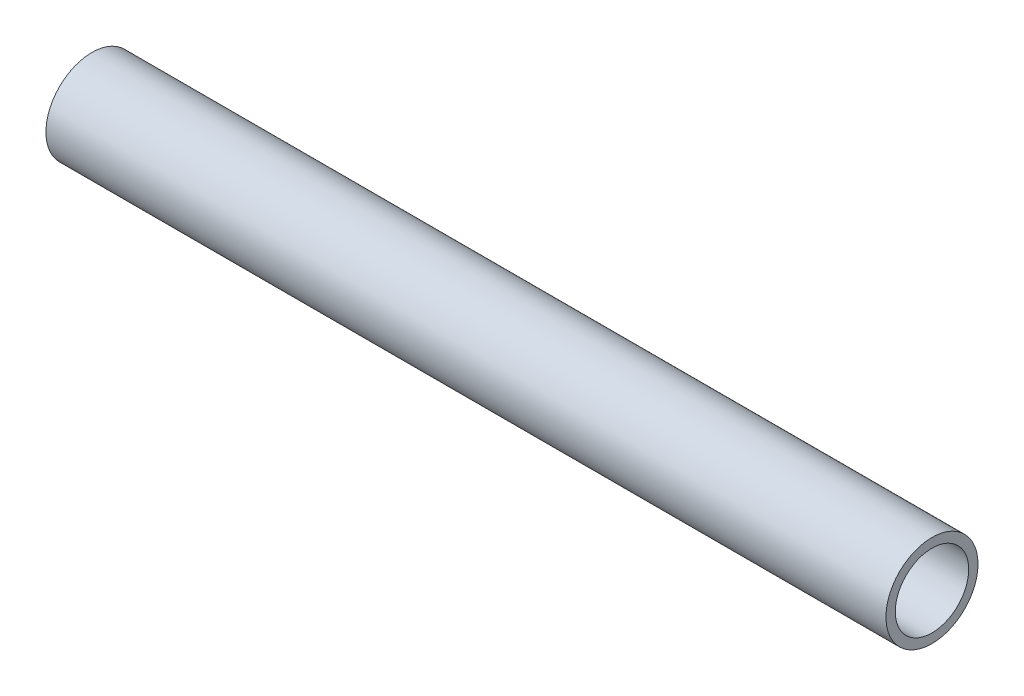
ISO-10303-21;
HEADER;
FILE_DESCRIPTION(('STEP AP214'),'2;1');
FILE_NAME('part.step','',(''),(''),'','','');
FILE_SCHEMA(('AUTOMOTIVE_DESIGN { 1 0 10303 214 1 1 1 1 }'));
ENDSEC;
DATA;
#1=APPLICATION_CONTEXT('core data for automotive mechanical design processes');
#2=APPLICATION_PROTOCOL_DEFINITION('international standard','automotive_design',2000,#1);
#3=PRODUCT_CONTEXT('',#1,'mechanical');
#4=PRODUCT('Part','Part','',(#3));
#5=PRODUCT_RELATED_PRODUCT_CATEGORY('part','',(#4));
#6=PRODUCT_DEFINITION_FORMATION('','',#4);
#7=PRODUCT_DEFINITION_CONTEXT('part definition',#1,'design');
#8=PRODUCT_DEFINITION('design','',#6,#7);
#9=PRODUCT_DEFINITION_SHAPE('','',#8);
#10=(LENGTH_UNIT() NAMED_UNIT(*) SI_UNIT(.MILLI.,.METRE.));
#11=(NAMED_UNIT(*) PLANE_ANGLE_UNIT() SI_UNIT($,.RADIAN.));
#12=(NAMED_UNIT(*) SI_UNIT($,.STERADIAN.) SOLID_ANGLE_UNIT());
#13=UNCERTAINTY_MEASURE_WITH_UNIT(LENGTH_MEASURE(1.E-05),#10,'distance_accuracy_value','');
#14=(GEOMETRIC_REPRESENTATION_CONTEXT(3) GLOBAL_UNCERTAINTY_ASSIGNED_CONTEXT((#13)) GLOBAL_UNIT_ASSIGNED_CONTEXT((#10,
#11,#12)) REPRESENTATION_CONTEXT('',''));
#15=CARTESIAN_POINT('',(0.,0.,0.));
#16=DIRECTION('',(0.,0.,1.));
#17=DIRECTION('',(1.,0.,0.));
#18=AXIS2_PLACEMENT_3D('',#15,#16,#17);
#19=CARTESIAN_POINT('',(0.,0.,-21.04263));
#20=DIRECTION('',(0.,0.,1.));
#21=DIRECTION('',(1.,0.,0.));
#22=AXIS2_PLACEMENT_3D('',#19,#20,#21);
#23=CYLINDRICAL_SURFACE('',#22,2.7051);
#24=CARTESIAN_POINT('',(2.7051,0.,-13.3223));
#25=CARTESIAN_POINT('',(2.705092770252,0.150134895986582,-13.322296453047));
#26=CARTESIAN_POINT('',(2.69254720896019,0.300455599655087,-13.3197336186402));
#27=CARTESIAN_POINT('',(2.64270335476511,0.596966096638184,-13.3097489860963));
#28=CARTESIAN_POINT('',(2.60535620334322,0.743147141080097,-13.3023175974179));
#29=CARTESIAN_POINT('',(2.50710998925604,1.02686798668373,-13.2834258688201));
#30=CARTESIAN_POINT('',(2.44624465733639,1.16441983725732,-13.2719713012418));
#31=CARTESIAN_POINT('',(2.30277724469893,1.4273083525318,-13.2462800387835));
#32=CARTESIAN_POINT('',(2.22018226779195,1.55264899098009,-13.2320442535243));
#33=CARTESIAN_POINT('',(2.03436150008406,1.78937507390252,-13.2021303510161));
#34=CARTESIAN_POINT('',(1.93088889645851,1.90056480475128,-13.1864363217807));
#35=CARTESIAN_POINT('',(1.70677569421369,2.10413997421407,-13.1554893636728));
#36=CARTESIAN_POINT('',(1.58613281446885,2.19652291031611,-13.1402364937343));
#37=CARTESIAN_POINT('',(1.32970892431112,2.36068379215464,-13.1117458561835));
#38=CARTESIAN_POINT('',(1.19379656988398,2.43226039894803,-13.0985283256397));
#39=CARTESIAN_POINT('',(0.911562701666267,2.5514858204215,-13.0758290266845));
#40=CARTESIAN_POINT('',(0.765242339422472,2.59913727750455,-13.0663468457489));
#41=CARTESIAN_POINT('',(0.468434920252348,2.66852907056716,-13.0523514429304));
#42=CARTESIAN_POINT('',(0.318030698908316,2.69061027436591,-13.0477729156619));
#43=CARTESIAN_POINT('',(0.0155878260643236,2.70929368040911,-13.0439067260276));
#44=CARTESIAN_POINT('',(-0.13645065389504,2.70589853120761,-13.0446185136737));
#45=CARTESIAN_POINT('',(-0.435344549658883,2.67400106753337,-13.0511932176885));
#46=CARTESIAN_POINT('',(-0.582243808601909,2.64589053647412,-13.0569757498549));
#47=CARTESIAN_POINT('',(-0.869198069426101,2.56597865941832,-13.0729138151156));
#48=CARTESIAN_POINT('',(-1.00925268321465,2.51417597179322,-13.0830695958541));
#49=CARTESIAN_POINT('',(-1.2796696554048,2.38797658400296,-13.1066919415131));
#50=CARTESIAN_POINT('',(-1.40995750281258,2.31342463475637,-13.1201811305812));
#51=CARTESIAN_POINT('',(-1.65631088764909,2.14395825187431,-13.1489347088269));
#52=CARTESIAN_POINT('',(-1.77237578242939,2.04904289867352,-13.1641991781579));
#53=CARTESIAN_POINT('',(-1.98923970617922,1.83946844350324,-13.1951291813348));
#54=CARTESIAN_POINT('',(-2.08971898241318,1.72447855229776,-13.210796930392));
#55=CARTESIAN_POINT('',(-2.27005761431752,1.47905263453857,-13.2405186714921));
#56=CARTESIAN_POINT('',(-2.34990792691539,1.34860987036524,-13.2545719543112));
#57=CARTESIAN_POINT('',(-2.48677940565961,1.07558481775857,-13.2795191243135));
#58=CARTESIAN_POINT('',(-2.54374477558704,0.932973874931196,-13.2904052720511));
#59=CARTESIAN_POINT('',(-2.63270639279091,0.640117866023641,-13.3077166911979));
#60=CARTESIAN_POINT('',(-2.66475503391298,0.489889530410063,-13.3141513199149));
#61=CARTESIAN_POINT('',(-2.69094744379556,0.282093829017848,-13.3194324809051));
#62=CARTESIAN_POINT('',(-2.69625006560105,0.225818805026408,-13.320505376802));
#63=CARTESIAN_POINT('',(-2.70332770739406,0.113037969108653,-13.3219398046502));
#64=CARTESIAN_POINT('',(-2.7051027223068,0.056532156850444,-13.3223013355783));
#65=CARTESIAN_POINT('',(-2.70509277025201,-0.150134895986582,-13.322296453047));
#66=CARTESIAN_POINT('',(-2.69254720896019,-0.300455599655086,-13.3197336186402));
#67=CARTESIAN_POINT('',(-2.6427033547651,-0.596966096638184,-13.3097489860963));
#68=CARTESIAN_POINT('',(-2.60535620334322,-0.743147141080097,-13.3023175974179));
#69=CARTESIAN_POINT('',(-2.50710998925604,-1.02686798668373,-13.2834258688201));
#70=CARTESIAN_POINT('',(-2.44624465733638,-1.16441983725732,-13.2719713012418));
#71=CARTESIAN_POINT('',(-2.30277724469893,-1.42730835253181,-13.2462800387835));
#72=CARTESIAN_POINT('',(-2.22018226779195,-1.55264899098009,-13.2320442535243));
#73=CARTESIAN_POINT('',(-2.03436150008406,-1.78937507390252,-13.2021303510161));
#74=CARTESIAN_POINT('',(-1.93088889645851,-1.90056480475128,-13.1864363217807));
#75=CARTESIAN_POINT('',(-1.70677569421369,-2.10413997421407,-13.1554893636728));
#76=CARTESIAN_POINT('',(-1.58613281446885,-2.19652291031611,-13.1402364937343));
#77=CARTESIAN_POINT('',(-1.32970892431112,-2.36068379215464,-13.1117458561835));
#78=CARTESIAN_POINT('',(-1.19379656988398,-2.43226039894803,-13.0985283256397));
#79=CARTESIAN_POINT('',(-0.911562701666266,-2.5514858204215,-13.0758290266845));
#80=CARTESIAN_POINT('',(-0.765242339422471,-2.59913727750455,-13.0663468457489));
#81=CARTESIAN_POINT('',(-0.468434920252347,-2.66852907056716,-13.0523514429304));
#82=CARTESIAN_POINT('',(-0.318030698908315,-2.69061027436591,-13.0477729156619));
#83=CARTESIAN_POINT('',(-0.0155878260643225,-2.70929368040911,-13.0439067260276));
#84=CARTESIAN_POINT('',(0.13645065389504,-2.70589853120761,-13.0446185136737));
#85=CARTESIAN_POINT('',(0.435344549658883,-2.67400106753337,-13.0511932176885));
#86=CARTESIAN_POINT('',(0.58224380860191,-2.64589053647411,-13.0569757498549));
#87=CARTESIAN_POINT('',(0.869198069426101,-2.56597865941832,-13.0729138151156));
#88=CARTESIAN_POINT('',(1.00925268321465,-2.51417597179322,-13.0830695958541));
#89=CARTESIAN_POINT('',(1.2796696554048,-2.38797658400296,-13.1066919415131));
#90=CARTESIAN_POINT('',(1.40995750281258,-2.31342463475637,-13.1201811305812));
#91=CARTESIAN_POINT('',(1.65631088764909,-2.14395825187431,-13.1489347088269));
#92=CARTESIAN_POINT('',(1.77237578242939,-2.04904289867352,-13.1641991781579));
#93=CARTESIAN_POINT('',(1.98923970617922,-1.83946844350324,-13.1951291813348));
#94=CARTESIAN_POINT('',(2.08971898241318,-1.72447855229776,-13.210796930392));
#95=CARTESIAN_POINT('',(2.27005761431752,-1.47905263453857,-13.2405186714921));
#96=CARTESIAN_POINT('',(2.34990792691539,-1.34860987036524,-13.2545719543112));
#97=CARTESIAN_POINT('',(2.48677940565961,-1.07558481775857,-13.2795191243135));
#98=CARTESIAN_POINT('',(2.54374477558704,-0.932973874931195,-13.2904052720511));
#99=CARTESIAN_POINT('',(2.63270639279091,-0.64011786602364,-13.3077166911979));
#100=CARTESIAN_POINT('',(2.66475503391298,-0.489889530410063,-13.3141513199149));
#101=CARTESIAN_POINT('',(2.69094744379556,-0.282093829017847,-13.3194324809051));
#102=CARTESIAN_POINT('',(2.69625006560105,-0.225818805026406,-13.320505376802));
#103=CARTESIAN_POINT('',(2.70332770739406,-0.113037969108651,-13.3219398046502));
#104=CARTESIAN_POINT('',(2.7051027223068,-0.0565321568504435,-13.3223013355783));
#105=CARTESIAN_POINT('',(2.7051,0.,-13.3223));
#106=B_SPLINE_CURVE_WITH_KNOTS('',3,(#24,#25,#26,#27,#28,#29,#30,#31,#32,#33,#34,#35,#36,#37,
#38,#39,#40,#41,#42,#43,#44,#45,#46,#47,#48,#49,#50,#51,#52,#53,#54,#55,#56,#57,#58,#59,#60,#61,
#62,#63,#64,#65,#66,#67,#68,#69,#70,#71,#72,#73,#74,#75,#76,#77,#78,#79,#80,#81,#82,#83,#84,#85,
#86,#87,#88,#89,#90,#91,#92,#93,#94,#95,#96,#97,#98,#99,#100,#101,#102,#103,#104,#105),
.UNSPECIFIED.,.T.,.F.,(4,2,2,2,2,2,2,2,2,2,2,2,2,2,2,2,2,2,2,2,2,2,2,2,2,2,2,2,2,2,2,2,2,2,2,2,
2,2,2,2,4),(0.,0.450188523853651,0.901266549267453,1.35170000706144,1.80198639266504,
2.25794583685643,2.71396591334758,3.17426214908979,3.63450753642172,4.08854424314986,
4.54253374829867,4.98945388452447,5.43639933187269,5.88646582195333,6.33655264029962,
6.79491105355946,7.25347005672623,7.71314039330976,8.17184152046139,8.34135635219493,
8.51087142779094,8.96105995164459,9.41213797705839,9.86257143485238,10.312857820456,
10.7688172646474,11.2248373411385,11.6851335768807,12.1453789642127,12.5994156709408,
13.0534051760896,13.5003253123154,13.9472707596636,14.3973372497443,14.8474240680906,
15.3057824813504,15.7643414845172,16.2240118211007,16.6827129482523,16.8522277799859,
17.0217428555819),.UNSPECIFIED.);
#107=CARTESIAN_POINT('',(2.7051,0.,-13.3223));
#108=VERTEX_POINT('',#107);
#109=EDGE_CURVE('E19',#108,#108,#106,.T.);
#110=ORIENTED_EDGE('',*,*,#109,.T.);
#111=EDGE_LOOP('',(#110));
#112=FACE_BOUND('',#111,.T.);
#113=CARTESIAN_POINT('',(-2.7051,0.,-16.7005));
#114=CARTESIAN_POINT('',(-2.70509309409082,-0.150741645900389,-16.7004972167994));
#115=CARTESIAN_POINT('',(-2.69244662908785,-0.301676265418033,-16.6984360194076));
#116=CARTESIAN_POINT('',(-2.64218308153297,-0.599428689470894,-16.6904065962194));
#117=CARTESIAN_POINT('',(-2.60451515704579,-0.746237476213944,-16.6844304157806));
#118=CARTESIAN_POINT('',(-2.50536828429985,-1.03122006902032,-16.6692417315316));
#119=CARTESIAN_POINT('',(-2.44391845032836,-1.16940419428775,-16.660033186124));
#120=CARTESIAN_POINT('',(-2.29901908866841,-1.43344185142085,-16.6393961399459));
#121=CARTESIAN_POINT('',(-2.2155778777378,-1.55930002012176,-16.6279684788355));
#122=CARTESIAN_POINT('',(-2.0282430238249,-1.79632952976378,-16.6040424837561));
#123=CARTESIAN_POINT('',(-1.92418722961853,-1.90737193048535,-16.5915361362649));
#124=CARTESIAN_POINT('',(-1.69892123634819,-2.11050674917163,-16.5669235979439));
#125=CARTESIAN_POINT('',(-1.57770910310208,-2.20259702762346,-16.5548174524225));
#126=CARTESIAN_POINT('',(-1.32070883935374,-2.36571099656375,-16.5323003324469));
#127=CARTESIAN_POINT('',(-1.18484059875069,-2.43660999618289,-16.521899548041));
#128=CARTESIAN_POINT('',(-0.90292816197871,-2.55453071935355,-16.5040798527835));
#129=CARTESIAN_POINT('',(-0.756884703159165,-2.60155417100947,-16.4966607261284));
#130=CARTESIAN_POINT('',(-0.460112840333474,-2.66999045968322,-16.4857227244895));
#131=CARTESIAN_POINT('',(-0.309436250543087,-2.69162255383434,-16.4821704782627));
#132=CARTESIAN_POINT('',(-0.0065530219699816,-2.70934169526446,-16.4792673885162));
#133=CARTESIAN_POINT('',(0.145653516419029,-2.70543040788935,-16.4799162710965));
#134=CARTESIAN_POINT('',(0.445714025154568,-2.67235264694948,-16.4853116310412));
#135=CARTESIAN_POINT('',(0.593595925602119,-2.64343208459313,-16.4900182085378));
#136=CARTESIAN_POINT('',(0.882381537342906,-2.5615419373464,-16.5029362887636));
#137=CARTESIAN_POINT('',(1.02328496344333,-2.5085713704904,-16.5111479346044));
#138=CARTESIAN_POINT('',(1.2948565931111,-2.37983166644533,-16.530194602301));
#139=CARTESIAN_POINT('',(1.42547489103507,-2.30395908225008,-16.5410414830344));
#140=CARTESIAN_POINT('',(1.67220906899206,-2.13164889454298,-16.5641270395111));
#141=CARTESIAN_POINT('',(1.78832496834256,-2.03521131842456,-16.5763657134006));
#142=CARTESIAN_POINT('',(2.00417355744576,-1.82318497653788,-16.6010299041729));
#143=CARTESIAN_POINT('',(2.10370232369518,-1.70738858354495,-16.6134559503886));
#144=CARTESIAN_POINT('',(2.28199165326535,-1.46056854668999,-16.6369703415384));
#145=CARTESIAN_POINT('',(2.36074289873228,-1.32953810881171,-16.6480580850943));
#146=CARTESIAN_POINT('',(2.4952510895887,-1.05574730966822,-16.6676621459182));
#147=CARTESIAN_POINT('',(2.55097187788182,-0.912968922644694,-16.6761744141994));
#148=CARTESIAN_POINT('',(2.63747319436241,-0.620100563644987,-16.689623933451));
#149=CARTESIAN_POINT('',(2.66830632702501,-0.470026728021121,-16.6945687225584));
#150=CARTESIAN_POINT('',(2.69254557599536,-0.265728002248771,-16.698470478202));
#151=CARTESIAN_POINT('',(2.69724972289396,-0.212701194892199,-16.6992299364118));
#152=CARTESIAN_POINT('',(2.70352815565814,-0.106457615956376,-16.7002451890075));
#153=CARTESIAN_POINT('',(2.70510243911649,-0.0532408442310525,-16.7005009830061));
#154=CARTESIAN_POINT('',(2.70509309409083,0.150741645900387,-16.7004972167994));
#155=CARTESIAN_POINT('',(2.69244662908785,0.301676265418031,-16.6984360194076));
#156=CARTESIAN_POINT('',(2.64218308153297,0.599428689470892,-16.6904065962194));
#157=CARTESIAN_POINT('',(2.60451515704579,0.746237476213943,-16.6844304157806));
#158=CARTESIAN_POINT('',(2.50536828429985,1.03122006902032,-16.6692417315316));
#159=CARTESIAN_POINT('',(2.44391845032837,1.16940419428775,-16.660033186124));
#160=CARTESIAN_POINT('',(2.29901908866841,1.43344185142085,-16.6393961399459));
#161=CARTESIAN_POINT('',(2.2155778777378,1.55930002012176,-16.6279684788355));
#162=CARTESIAN_POINT('',(2.0282430238249,1.79632952976378,-16.6040424837561));
#163=CARTESIAN_POINT('',(1.92418722961853,1.90737193048535,-16.5915361362649));
#164=CARTESIAN_POINT('',(1.69892123634819,2.11050674917163,-16.5669235979439));
#165=CARTESIAN_POINT('',(1.57770910310208,2.20259702762346,-16.5548174524225));
#166=CARTESIAN_POINT('',(1.32070883935374,2.36571099656375,-16.5323003324469));
#167=CARTESIAN_POINT('',(1.18484059875069,2.43660999618289,-16.521899548041));
#168=CARTESIAN_POINT('',(0.902928161978712,2.55453071935355,-16.5040798527835));
#169=CARTESIAN_POINT('',(0.756884703159167,2.60155417100947,-16.4966607261284));
#170=CARTESIAN_POINT('',(0.460112840333476,2.66999045968322,-16.4857227244895));
#171=CARTESIAN_POINT('',(0.309436250543088,2.69162255383434,-16.4821704782627));
#172=CARTESIAN_POINT('',(0.0065530219699829,2.70934169526446,-16.4792673885162));
#173=CARTESIAN_POINT('',(-0.145653516419027,2.70543040788935,-16.4799162710965));
#174=CARTESIAN_POINT('',(-0.445714025154566,2.67235264694948,-16.4853116310412));
#175=CARTESIAN_POINT('',(-0.593595925602117,2.64343208459313,-16.4900182085378));
#176=CARTESIAN_POINT('',(-0.882381537342904,2.5615419373464,-16.5029362887636));
#177=CARTESIAN_POINT('',(-1.02328496344333,2.5085713704904,-16.5111479346044));
#178=CARTESIAN_POINT('',(-1.2948565931111,2.37983166644533,-16.530194602301));
#179=CARTESIAN_POINT('',(-1.42547489103506,2.30395908225008,-16.5410414830344));
#180=CARTESIAN_POINT('',(-1.67220906899206,2.13164889454298,-16.5641270395111));
#181=CARTESIAN_POINT('',(-1.78832496834256,2.03521131842456,-16.5763657134006));
#182=CARTESIAN_POINT('',(-2.00417355744576,1.82318497653788,-16.6010299041729));
#183=CARTESIAN_POINT('',(-2.10370232369518,1.70738858354495,-16.6134559503886));
#184=CARTESIAN_POINT('',(-2.28199165326535,1.46056854668999,-16.6369703415384));
#185=CARTESIAN_POINT('',(-2.36074289873228,1.32953810881171,-16.6480580850943));
#186=CARTESIAN_POINT('',(-2.4952510895887,1.05574730966822,-16.6676621459182));
#187=CARTESIAN_POINT('',(-2.55097187788182,0.912968922644696,-16.6761744141994));
#188=CARTESIAN_POINT('',(-2.63747319436241,0.620100563644988,-16.689623933451));
#189=CARTESIAN_POINT('',(-2.66830632702501,0.470026728021122,-16.6945687225584));
#190=CARTESIAN_POINT('',(-2.69254557599536,0.265728002248771,-16.698470478202));
#191=CARTESIAN_POINT('',(-2.69724972289396,0.212701194892198,-16.6992299364118));
#192=CARTESIAN_POINT('',(-2.70352815565814,0.106457615956374,-16.7002451890075));
#193=CARTESIAN_POINT('',(-2.70510243911649,0.0532408442310505,-16.7005009830061));
#194=CARTESIAN_POINT('',(-2.7051,0.,-16.7005));
#195=B_SPLINE_CURVE_WITH_KNOTS('',3,(#113,#114,#115,#116,#117,#118,#119,#120,#121,#122,#123,
#124,#125,#126,#127,#128,#129,#130,#131,#132,#133,#134,#135,#136,#137,#138,#139,#140,#141,#142,
#143,#144,#145,#146,#147,#148,#149,#150,#151,#152,#153,#154,#155,#156,#157,#158,#159,#160,#161,
#162,#163,#164,#165,#166,#167,#168,#169,#170,#171,#172,#173,#174,#175,#176,#177,#178,#179,#180,
#181,#182,#183,#184,#185,#186,#187,#188,#189,#190,#191,#192,#193,#194),.UNSPECIFIED.,.T.,.F.,(4,
2,2,2,2,2,2,2,2,2,2,2,2,2,2,2,2,2,2,2,2,2,2,2,2,2,2,2,2,2,2,2,2,2,2,2,2,2,2,2,4),(0.,
0.452021756707174,0.904964812536633,1.35735511158987,1.80957456935384,2.26550345577038,
2.72148378398677,3.18009657555907,3.63867616815269,4.09326604447021,4.54782628329346,
4.99796709718931,5.44812629206122,5.90035005434439,6.3525732142505,6.81000074402256,
7.26763306366753,7.72598114739338,8.1833578753983,8.34300852326367,8.50265929391929,
8.95468105062646,9.40762410645592,9.86001440550916,10.3122338632731,10.7681627496897,
11.2241430779061,11.6827558694783,12.141335462072,12.5959253383895,13.0504855772127,
13.5006263911086,13.9507855859805,14.4030093482637,14.8552325081698,15.3126600379418,
15.7702923575868,16.2286404413127,16.6860171693176,16.845667817183,17.0053185878386),.UNSPECIFIED.);
#196=CARTESIAN_POINT('',(-2.7051,0.,-16.7005));
#197=VERTEX_POINT('',#196);
#198=EDGE_CURVE('E35',#197,#197,#195,.T.);
#199=ORIENTED_EDGE('',*,*,#198,.F.);
#200=EDGE_LOOP('',(#199));
#201=FACE_BOUND('',#200,.T.);
#202=ADVANCED_FACE('F15',(#112,#201),#23,.F.);
#203=CARTESIAN_POINT('',(-152.4,0.,0.));
#204=DIRECTION('',(1.,0.,0.));
#205=DIRECTION('',(0.,0.,-1.));
#206=AXIS2_PLACEMENT_3D('',#203,#204,#205);
#207=CYLINDRICAL_SURFACE('',#206,13.3223);
#208=CARTESIAN_POINT('',(152.4,0.,0.));
#209=DIRECTION('',(1.,0.,0.));
#210=DIRECTION('',(0.,0.,-1.));
#211=AXIS2_PLACEMENT_3D('',#208,#209,#210);
#212=CIRCLE('',#211,13.3223);
#213=CARTESIAN_POINT('',(152.4,0.,-13.3223));
#214=VERTEX_POINT('',#213);
#215=EDGE_CURVE('E40',#214,#214,#212,.F.);
#216=ORIENTED_EDGE('',*,*,#215,.F.);
#217=EDGE_LOOP('',(#216));
#218=FACE_BOUND('',#217,.T.);
#219=ORIENTED_EDGE('',*,*,#109,.F.);
#220=EDGE_LOOP('',(#219));
#221=FACE_BOUND('',#220,.T.);
#222=CARTESIAN_POINT('',(-152.4,0.,0.));
#223=DIRECTION('',(1.,0.,0.));
#224=DIRECTION('',(0.,0.,-1.));
#225=AXIS2_PLACEMENT_3D('',#222,#223,#224);
#226=CIRCLE('',#225,13.3223);
#227=CARTESIAN_POINT('',(-152.4,0.,-13.3223));
#228=VERTEX_POINT('',#227);
#229=EDGE_CURVE('E30',#228,#228,#226,.F.);
#230=ORIENTED_EDGE('',*,*,#229,.T.);
#231=EDGE_LOOP('',(#230));
#232=FACE_BOUND('',#231,.T.);
#233=ADVANCED_FACE('F52',(#218,#221,#232),#207,.F.);
#234=CARTESIAN_POINT('',(152.4,0.,0.));
#235=DIRECTION('',(1.,0.,0.));
#236=DIRECTION('',(0.,0.,-1.));
#237=AXIS2_PLACEMENT_3D('',#234,#235,#236);
#238=PLANE('',#237);
#239=ORIENTED_EDGE('',*,*,#215,.T.);
#240=EDGE_LOOP('',(#239));
#241=FACE_BOUND('',#240,.T.);
#242=CARTESIAN_POINT('',(152.4,0.,0.));
#243=DIRECTION('',(1.,0.,0.));
#244=DIRECTION('',(0.,0.,-1.));
#245=AXIS2_PLACEMENT_3D('',#242,#243,#244);
#246=CIRCLE('',#245,16.7005);
#247=CARTESIAN_POINT('',(152.4,0.,-16.7005));
#248=VERTEX_POINT('',#247);
#249=EDGE_CURVE('E25',#248,#248,#246,.F.);
#250=ORIENTED_EDGE('',*,*,#249,.F.);
#251=EDGE_LOOP('',(#250));
#252=FACE_BOUND('',#251,.T.);
#253=ADVANCED_FACE('F49',(#241,#252),#238,.T.);
#254=CARTESIAN_POINT('',(-152.4,0.,0.));
#255=DIRECTION('',(1.,0.,0.));
#256=DIRECTION('',(0.,0.,-1.));
#257=AXIS2_PLACEMENT_3D('',#254,#255,#256);
#258=PLANE('',#257);
#259=ORIENTED_EDGE('',*,*,#229,.F.);
#260=EDGE_LOOP('',(#259));
#261=FACE_BOUND('',#260,.T.);
#262=CARTESIAN_POINT('',(-152.4,0.,0.));
#263=DIRECTION('',(1.,0.,0.));
#264=DIRECTION('',(0.,0.,-1.));
#265=AXIS2_PLACEMENT_3D('',#262,#263,#264);
#266=CIRCLE('',#265,16.7005);
#267=CARTESIAN_POINT('',(-152.4,0.,-16.7005));
#268=VERTEX_POINT('',#267);
#269=EDGE_CURVE('E10',#268,#268,#266,.T.);
#270=ORIENTED_EDGE('',*,*,#269,.F.);
#271=EDGE_LOOP('',(#270));
#272=FACE_BOUND('',#271,.T.);
#273=ADVANCED_FACE('F45',(#261,#272),#258,.F.);
#274=CARTESIAN_POINT('',(-152.4,0.,0.));
#275=DIRECTION('',(1.,0.,0.));
#276=DIRECTION('',(0.,0.,-1.));
#277=AXIS2_PLACEMENT_3D('',#274,#275,#276);
#278=CYLINDRICAL_SURFACE('',#277,16.7005);
#279=ORIENTED_EDGE('',*,*,#249,.T.);
#280=EDGE_LOOP('',(#279));
#281=FACE_BOUND('',#280,.T.);
#282=ORIENTED_EDGE('',*,*,#269,.T.);
#283=EDGE_LOOP('',(#282));
#284=FACE_BOUND('',#283,.T.);
#285=ORIENTED_EDGE('',*,*,#198,.T.);
#286=EDGE_LOOP('',(#285));
#287=FACE_BOUND('',#286,.T.);
#288=ADVANCED_FACE('F41',(#281,#284,#287),#278,.T.);
#289=CLOSED_SHELL('',(#202,#233,#253,#273,#288));
#290=MANIFOLD_SOLID_BREP('B1',#289);
#291=ADVANCED_BREP_SHAPE_REPRESENTATION('',(#18,#290),#14);
#292=SHAPE_DEFINITION_REPRESENTATION(#9,#291);
ENDSEC;
END-ISO-10303-21;
